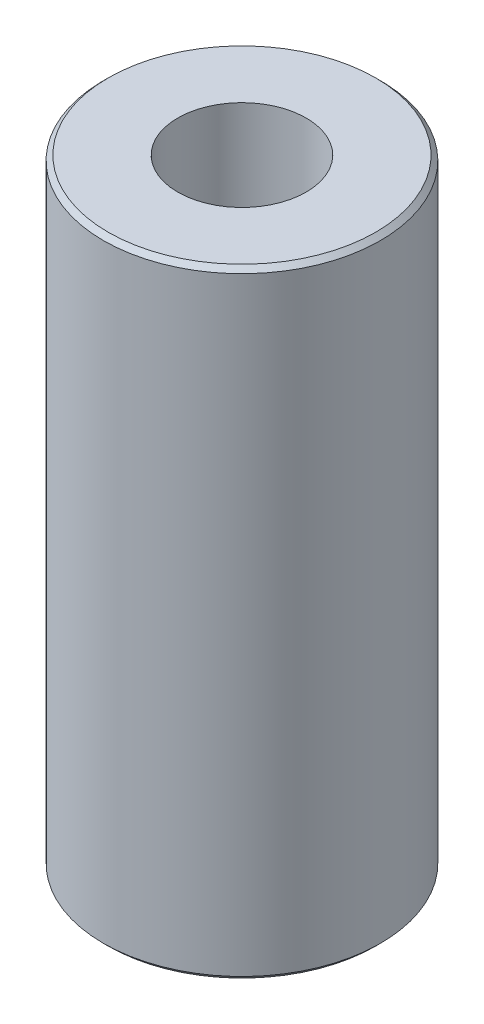
ISO-10303-21;
HEADER;
FILE_DESCRIPTION(('STEP AP214'),'2;1');
FILE_NAME('part.step','',(''),(''),'','','');
FILE_SCHEMA(('AUTOMOTIVE_DESIGN { 1 0 10303 214 1 1 1 1 }'));
ENDSEC;
DATA;
#1=APPLICATION_CONTEXT('core data for automotive mechanical design processes');
#2=APPLICATION_PROTOCOL_DEFINITION('international standard','automotive_design',2000,#1);
#3=PRODUCT_CONTEXT('',#1,'mechanical');
#4=PRODUCT('Part','Part','',(#3));
#5=PRODUCT_RELATED_PRODUCT_CATEGORY('part','',(#4));
#6=PRODUCT_DEFINITION_FORMATION('','',#4);
#7=PRODUCT_DEFINITION_CONTEXT('part definition',#1,'design');
#8=PRODUCT_DEFINITION('design','',#6,#7);
#9=PRODUCT_DEFINITION_SHAPE('','',#8);
#10=(LENGTH_UNIT() NAMED_UNIT(*) SI_UNIT(.MILLI.,.METRE.));
#11=(NAMED_UNIT(*) PLANE_ANGLE_UNIT() SI_UNIT($,.RADIAN.));
#12=(NAMED_UNIT(*) SI_UNIT($,.STERADIAN.) SOLID_ANGLE_UNIT());
#13=UNCERTAINTY_MEASURE_WITH_UNIT(LENGTH_MEASURE(1.E-05),#10,'distance_accuracy_value','');
#14=(GEOMETRIC_REPRESENTATION_CONTEXT(3) GLOBAL_UNCERTAINTY_ASSIGNED_CONTEXT((#13)) GLOBAL_UNIT_ASSIGNED_CONTEXT((#10,
#11,#12)) REPRESENTATION_CONTEXT('',''));
#15=CARTESIAN_POINT('',(0.,0.,0.));
#16=DIRECTION('',(0.,0.,1.));
#17=DIRECTION('',(1.,0.,0.));
#18=AXIS2_PLACEMENT_3D('',#15,#16,#17);
#19=CARTESIAN_POINT('',(0.,267.789359421665,0.));
#20=DIRECTION('',(0.,-1.,0.));
#21=DIRECTION('',(0.,0.,-1.));
#22=AXIS2_PLACEMENT_3D('',#19,#20,#21);
#23=CYLINDRICAL_SURFACE('',#22,60.);
#24=CARTESIAN_POINT('',(0.,265.707986354334,0.));
#25=DIRECTION('',(0.,1.,0.));
#26=DIRECTION('',(0.,0.,1.));
#27=AXIS2_PLACEMENT_3D('',#24,#25,#26);
#28=CIRCLE('',#27,60.);
#29=CARTESIAN_POINT('',(0.,265.707986354334,60.));
#30=VERTEX_POINT('',#29);
#31=EDGE_CURVE('E50',#30,#30,#28,.F.);
#32=ORIENTED_EDGE('',*,*,#31,.T.);
#33=EDGE_LOOP('',(#32));
#34=FACE_BOUND('',#33,.T.);
#35=CARTESIAN_POINT('',(0.,2.08137306733158,0.));
#36=DIRECTION('',(0.,1.,0.));
#37=DIRECTION('',(0.,0.,1.));
#38=AXIS2_PLACEMENT_3D('',#35,#36,#37);
#39=CIRCLE('',#38,60.);
#40=CARTESIAN_POINT('',(0.,2.08137306733158,60.));
#41=VERTEX_POINT('',#40);
#42=EDGE_CURVE('E51',#41,#41,#39,.T.);
#43=ORIENTED_EDGE('',*,*,#42,.T.);
#44=EDGE_LOOP('',(#43));
#45=FACE_BOUND('',#44,.T.);
#46=ADVANCED_FACE('F39',(#34,#45),#23,.T.);
#47=CARTESIAN_POINT('',(0.,267.789359421665,0.));
#48=DIRECTION('',(0.,1.,0.));
#49=DIRECTION('',(0.,0.,1.));
#50=AXIS2_PLACEMENT_3D('',#47,#48,#49);
#51=PLANE('',#50);
#52=CARTESIAN_POINT('',(0.,267.789359421665,0.));
#53=DIRECTION('',(0.,1.,0.));
#54=DIRECTION('',(0.,0.,1.));
#55=AXIS2_PLACEMENT_3D('',#52,#53,#54);
#56=CIRCLE('',#55,57.9186269326685);
#57=CARTESIAN_POINT('',(0.,267.789359421665,57.9186269326685));
#58=VERTEX_POINT('',#57);
#59=EDGE_CURVE('E54',#58,#58,#56,.T.);
#60=ORIENTED_EDGE('',*,*,#59,.T.);
#61=EDGE_LOOP('',(#60));
#62=FACE_BOUND('',#61,.T.);
#63=CARTESIAN_POINT('',(0.,267.789359421665,0.));
#64=DIRECTION('',(0.,1.,0.));
#65=DIRECTION('',(0.,0.,1.));
#66=AXIS2_PLACEMENT_3D('',#63,#64,#65);
#67=CIRCLE('',#66,27.8214195924935);
#68=CARTESIAN_POINT('',(0.,267.789359421665,27.8214195924935));
#69=VERTEX_POINT('',#68);
#70=EDGE_CURVE('E58',#69,#69,#67,.T.);
#71=ORIENTED_EDGE('',*,*,#70,.F.);
#72=EDGE_LOOP('',(#71));
#73=FACE_BOUND('',#72,.T.);
#74=ADVANCED_FACE('F69',(#62,#73),#51,.T.);
#75=CARTESIAN_POINT('',(0.,0.,0.));
#76=DIRECTION('',(0.,1.,0.));
#77=DIRECTION('',(0.,0.,1.));
#78=AXIS2_PLACEMENT_3D('',#75,#76,#77);
#79=PLANE('',#78);
#80=CARTESIAN_POINT('',(0.,0.,0.));
#81=DIRECTION('',(0.,1.,0.));
#82=DIRECTION('',(0.,0.,1.));
#83=AXIS2_PLACEMENT_3D('',#80,#81,#82);
#84=CIRCLE('',#83,57.9186269326684);
#85=CARTESIAN_POINT('',(0.,0.,57.9186269326684));
#86=VERTEX_POINT('',#85);
#87=EDGE_CURVE('E10',#86,#86,#84,.F.);
#88=ORIENTED_EDGE('',*,*,#87,.T.);
#89=EDGE_LOOP('',(#88));
#90=FACE_BOUND('',#89,.T.);
#91=CARTESIAN_POINT('',(0.,0.,0.));
#92=DIRECTION('',(0.,1.,0.));
#93=DIRECTION('',(0.,0.,1.));
#94=AXIS2_PLACEMENT_3D('',#91,#92,#93);
#95=CIRCLE('',#94,27.8214195924935);
#96=CARTESIAN_POINT('',(0.,0.,27.8214195924935));
#97=VERTEX_POINT('',#96);
#98=EDGE_CURVE('E63',#97,#97,#95,.T.);
#99=ORIENTED_EDGE('',*,*,#98,.T.);
#100=EDGE_LOOP('',(#99));
#101=FACE_BOUND('',#100,.T.);
#102=ADVANCED_FACE('F75',(#90,#101),#79,.F.);
#103=CARTESIAN_POINT('',(0.,267.789359421665,0.));
#104=DIRECTION('',(0.,-1.,0.));
#105=DIRECTION('',(0.,0.,-1.));
#106=AXIS2_PLACEMENT_3D('',#103,#104,#105);
#107=CYLINDRICAL_SURFACE('',#106,27.8214195924935);
#108=ORIENTED_EDGE('',*,*,#70,.T.);
#109=EDGE_LOOP('',(#108));
#110=FACE_BOUND('',#109,.T.);
#111=ORIENTED_EDGE('',*,*,#98,.F.);
#112=EDGE_LOOP('',(#111));
#113=FACE_BOUND('',#112,.T.);
#114=ADVANCED_FACE('F70',(#110,#113),#107,.F.);
#115=CARTESIAN_POINT('',(0.,267.789359421665,0.));
#116=DIRECTION('',(0.,-1.,0.));
#117=DIRECTION('',(0.,0.,-1.));
#118=AXIS2_PLACEMENT_3D('',#115,#116,#117);
#119=CONICAL_SURFACE('',#118,57.9186269326685,0.785398163397462);
#120=ORIENTED_EDGE('',*,*,#31,.F.);
#121=EDGE_LOOP('',(#120));
#122=FACE_BOUND('',#121,.T.);
#123=ORIENTED_EDGE('',*,*,#59,.F.);
#124=EDGE_LOOP('',(#123));
#125=FACE_BOUND('',#124,.T.);
#126=ADVANCED_FACE('F81',(#122,#125),#119,.T.);
#127=CARTESIAN_POINT('',(0.,2.08137306733158,0.));
#128=DIRECTION('',(0.,1.,0.));
#129=DIRECTION('',(0.,0.,1.));
#130=AXIS2_PLACEMENT_3D('',#127,#128,#129);
#131=CONICAL_SURFACE('',#130,60.,0.785398163397448);
#132=ORIENTED_EDGE('',*,*,#87,.F.);
#133=EDGE_LOOP('',(#132));
#134=FACE_BOUND('',#133,.T.);
#135=ORIENTED_EDGE('',*,*,#42,.F.);
#136=EDGE_LOOP('',(#135));
#137=FACE_BOUND('',#136,.T.);
#138=ADVANCED_FACE('F45',(#134,#137),#131,.T.);
#139=CLOSED_SHELL('',(#46,#74,#102,#114,#126,#138));
#140=MANIFOLD_SOLID_BREP('B2',#139);
#141=ADVANCED_BREP_SHAPE_REPRESENTATION('',(#18,#140),#14);
#142=SHAPE_DEFINITION_REPRESENTATION(#9,#141);
ENDSEC;
END-ISO-10303-21;
